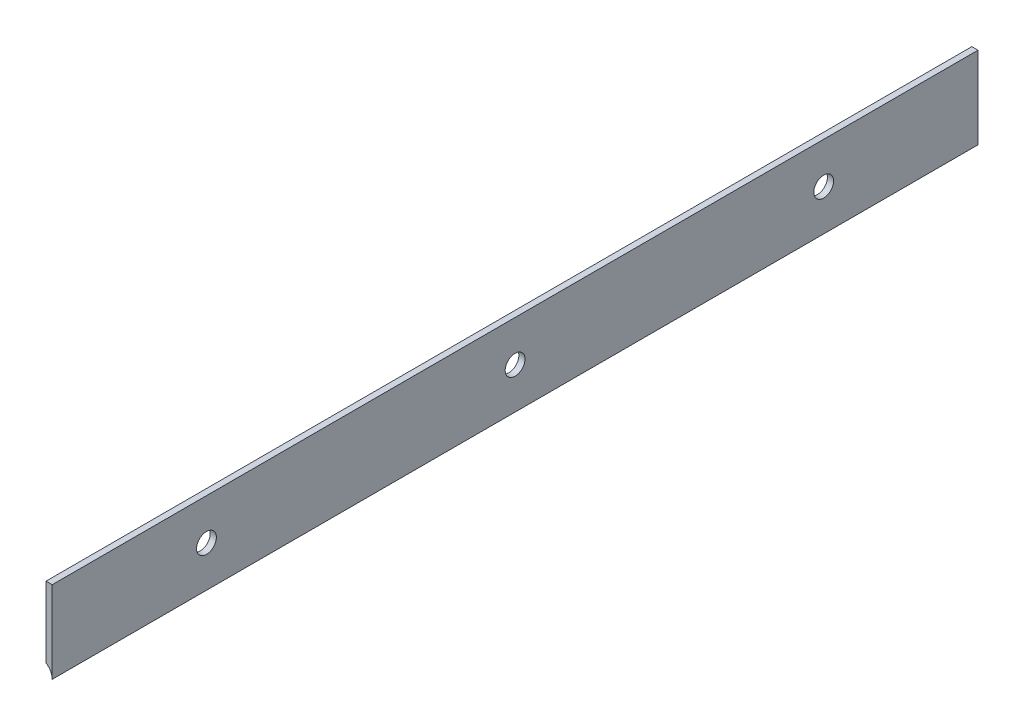
ISO-10303-21;
HEADER;
FILE_DESCRIPTION(('STEP AP214'),'2;1');
FILE_NAME('part.step','',(''),(''),'','','');
FILE_SCHEMA(('AUTOMOTIVE_DESIGN { 1 0 10303 214 1 1 1 1 }'));
ENDSEC;
DATA;
#1=APPLICATION_CONTEXT('core data for automotive mechanical design processes');
#2=APPLICATION_PROTOCOL_DEFINITION('international standard','automotive_design',2000,#1);
#3=PRODUCT_CONTEXT('',#1,'mechanical');
#4=PRODUCT('Part','Part','',(#3));
#5=PRODUCT_RELATED_PRODUCT_CATEGORY('part','',(#4));
#6=PRODUCT_DEFINITION_FORMATION('','',#4);
#7=PRODUCT_DEFINITION_CONTEXT('part definition',#1,'design');
#8=PRODUCT_DEFINITION('design','',#6,#7);
#9=PRODUCT_DEFINITION_SHAPE('','',#8);
#10=(LENGTH_UNIT() NAMED_UNIT(*) SI_UNIT(.MILLI.,.METRE.));
#11=(NAMED_UNIT(*) PLANE_ANGLE_UNIT() SI_UNIT($,.RADIAN.));
#12=(NAMED_UNIT(*) SI_UNIT($,.STERADIAN.) SOLID_ANGLE_UNIT());
#13=UNCERTAINTY_MEASURE_WITH_UNIT(LENGTH_MEASURE(1.E-05),#10,'distance_accuracy_value','');
#14=(GEOMETRIC_REPRESENTATION_CONTEXT(3) GLOBAL_UNCERTAINTY_ASSIGNED_CONTEXT((#13)) GLOBAL_UNIT_ASSIGNED_CONTEXT((#10,
#11,#12)) REPRESENTATION_CONTEXT('',''));
#15=CARTESIAN_POINT('',(0.,0.,0.));
#16=DIRECTION('',(0.,0.,1.));
#17=DIRECTION('',(1.,0.,0.));
#18=AXIS2_PLACEMENT_3D('',#15,#16,#17);
#19=CARTESIAN_POINT('',(0.507999999999999,-6.746875,152.4));
#20=DIRECTION('',(-1.,0.,0.));
#21=DIRECTION('',(0.,0.,1.));
#22=AXIS2_PLACEMENT_3D('',#19,#20,#21);
#23=PLANE('',#22);
#24=CARTESIAN_POINT('',(0.508,7.21644966006352E-13,25.4000000000001));
#25=DIRECTION('',(1.,0.,0.));
#26=DIRECTION('',(0.,0.,-1.));
#27=AXIS2_PLACEMENT_3D('',#24,#25,#26);
#28=CIRCLE('',#27,1.63194999999999);
#29=CARTESIAN_POINT('',(0.508,7.21644966006352E-13,23.7680500000001));
#30=VERTEX_POINT('',#29);
#31=EDGE_CURVE('E119',#30,#30,#28,.T.);
#32=ORIENTED_EDGE('',*,*,#31,.F.);
#33=EDGE_LOOP('',(#32));
#34=FACE_BOUND('',#33,.T.);
#35=CARTESIAN_POINT('',(0.508,5.55111512312578E-13,76.2));
#36=DIRECTION('',(1.,0.,0.));
#37=DIRECTION('',(0.,0.,-1.));
#38=AXIS2_PLACEMENT_3D('',#35,#36,#37);
#39=CIRCLE('',#38,1.63194999999999);
#40=CARTESIAN_POINT('',(0.508,5.55111512312578E-13,74.5680500000001));
#41=VERTEX_POINT('',#40);
#42=EDGE_CURVE('E109',#41,#41,#39,.T.);
#43=ORIENTED_EDGE('',*,*,#42,.F.);
#44=EDGE_LOOP('',(#43));
#45=FACE_BOUND('',#44,.T.);
#46=CARTESIAN_POINT('',(0.508,3.33066907387547E-13,127.));
#47=DIRECTION('',(1.,0.,0.));
#48=DIRECTION('',(0.,0.,-1.));
#49=AXIS2_PLACEMENT_3D('',#46,#47,#48);
#50=CIRCLE('',#49,1.63194999999999);
#51=CARTESIAN_POINT('',(0.508,3.33066907387547E-13,125.36805));
#52=VERTEX_POINT('',#51);
#53=EDGE_CURVE('E108',#52,#52,#50,.T.);
#54=ORIENTED_EDGE('',*,*,#53,.F.);
#55=EDGE_LOOP('',(#54));
#56=FACE_BOUND('',#55,.T.);
#57=DIRECTION('',(0.,1.,0.));
#58=VECTOR('',#57,1.);
#59=CARTESIAN_POINT('',(0.507999999999999,-6.746875,0.));
#60=LINE('',#59,#58);
#61=CARTESIAN_POINT('',(0.507999999999998,-6.746875,0.));
#62=VERTEX_POINT('',#61);
#63=CARTESIAN_POINT('',(0.507999999999999,6.746875,0.));
#64=VERTEX_POINT('',#63);
#65=EDGE_CURVE('E98',#62,#64,#60,.T.);
#66=ORIENTED_EDGE('',*,*,#65,.T.);
#67=DIRECTION('',(0.,0.,-1.));
#68=VECTOR('',#67,1.);
#69=CARTESIAN_POINT('',(0.507999999999999,6.746875,152.4));
#70=LINE('',#69,#68);
#71=CARTESIAN_POINT('',(0.507999999999999,6.746875,152.4));
#72=VERTEX_POINT('',#71);
#73=EDGE_CURVE('E11',#72,#64,#70,.T.);
#74=ORIENTED_EDGE('',*,*,#73,.F.);
#75=DIRECTION('',(0.,1.,0.));
#76=VECTOR('',#75,1.);
#77=CARTESIAN_POINT('',(0.507999999999999,-6.746875,152.4));
#78=LINE('',#77,#76);
#79=CARTESIAN_POINT('',(0.507999999999998,-6.746875,152.4));
#80=VERTEX_POINT('',#79);
#81=EDGE_CURVE('E85',#80,#72,#78,.T.);
#82=ORIENTED_EDGE('',*,*,#81,.F.);
#83=DIRECTION('',(0.,0.,-1.));
#84=VECTOR('',#83,1.);
#85=CARTESIAN_POINT('',(0.507999999999998,-6.746875,152.4));
#86=LINE('',#85,#84);
#87=EDGE_CURVE('E94',#80,#62,#86,.T.);
#88=ORIENTED_EDGE('',*,*,#87,.T.);
#89=EDGE_LOOP('',(#66,#74,#82,#88));
#90=FACE_BOUND('',#89,.T.);
#91=ADVANCED_FACE('F32',(#34,#45,#56,#90),#23,.F.);
#92=CARTESIAN_POINT('',(-0.508000000000001,6.746875,152.4));
#93=DIRECTION('',(0.,-1.,0.));
#94=DIRECTION('',(0.,0.,-1.));
#95=AXIS2_PLACEMENT_3D('',#92,#93,#94);
#96=PLANE('',#95);
#97=DIRECTION('',(-1.,0.,0.));
#98=VECTOR('',#97,1.);
#99=CARTESIAN_POINT('',(-0.508000000000001,6.746875,0.));
#100=LINE('',#99,#98);
#101=CARTESIAN_POINT('',(-0.508000000000001,6.746875,0.));
#102=VERTEX_POINT('',#101);
#103=EDGE_CURVE('E89',#64,#102,#100,.T.);
#104=ORIENTED_EDGE('',*,*,#103,.T.);
#105=DIRECTION('',(0.,0.,-1.));
#106=VECTOR('',#105,1.);
#107=CARTESIAN_POINT('',(-0.508000000000001,6.746875,152.4));
#108=LINE('',#107,#106);
#109=CARTESIAN_POINT('',(-0.508000000000001,6.746875,152.4));
#110=VERTEX_POINT('',#109);
#111=EDGE_CURVE('E41',#110,#102,#108,.T.);
#112=ORIENTED_EDGE('',*,*,#111,.F.);
#113=DIRECTION('',(-1.,0.,0.));
#114=VECTOR('',#113,1.);
#115=CARTESIAN_POINT('',(-0.508000000000001,6.746875,152.4));
#116=LINE('',#115,#114);
#117=EDGE_CURVE('E80',#72,#110,#116,.T.);
#118=ORIENTED_EDGE('',*,*,#117,.F.);
#119=ORIENTED_EDGE('',*,*,#73,.T.);
#120=EDGE_LOOP('',(#104,#112,#118,#119));
#121=FACE_BOUND('',#120,.T.);
#122=ADVANCED_FACE('F88',(#121),#96,.F.);
#123=CARTESIAN_POINT('',(-0.508000000000001,-4.91525495206429,152.4));
#124=DIRECTION('',(1.,0.,0.));
#125=DIRECTION('',(0.,0.,-1.));
#126=AXIS2_PLACEMENT_3D('',#123,#124,#125);
#127=PLANE('',#126);
#128=CARTESIAN_POINT('',(-0.508000000000001,7.21644966006352E-13,25.4000000000001));
#129=DIRECTION('',(1.,0.,0.));
#130=DIRECTION('',(0.,0.,-1.));
#131=AXIS2_PLACEMENT_3D('',#128,#129,#130);
#132=CIRCLE('',#131,1.63194999999999);
#133=CARTESIAN_POINT('',(-0.508000000000001,7.21644966006352E-13,23.7680500000001));
#134=VERTEX_POINT('',#133);
#135=EDGE_CURVE('E35',#134,#134,#132,.T.);
#136=ORIENTED_EDGE('',*,*,#135,.T.);
#137=EDGE_LOOP('',(#136));
#138=FACE_BOUND('',#137,.T.);
#139=CARTESIAN_POINT('',(-0.508000000000001,5.55111512312578E-13,76.2));
#140=DIRECTION('',(1.,0.,0.));
#141=DIRECTION('',(0.,0.,-1.));
#142=AXIS2_PLACEMENT_3D('',#139,#140,#141);
#143=CIRCLE('',#142,1.63194999999999);
#144=CARTESIAN_POINT('',(-0.508000000000001,5.55111512312578E-13,74.5680500000001));
#145=VERTEX_POINT('',#144);
#146=EDGE_CURVE('E106',#145,#145,#143,.T.);
#147=ORIENTED_EDGE('',*,*,#146,.T.);
#148=EDGE_LOOP('',(#147));
#149=FACE_BOUND('',#148,.T.);
#150=CARTESIAN_POINT('',(-0.508000000000001,3.33066907387547E-13,127.));
#151=DIRECTION('',(1.,0.,0.));
#152=DIRECTION('',(0.,0.,-1.));
#153=AXIS2_PLACEMENT_3D('',#150,#151,#152);
#154=CIRCLE('',#153,1.63194999999999);
#155=CARTESIAN_POINT('',(-0.508000000000001,3.33066907387547E-13,125.36805));
#156=VERTEX_POINT('',#155);
#157=EDGE_CURVE('E101',#156,#156,#154,.T.);
#158=ORIENTED_EDGE('',*,*,#157,.T.);
#159=EDGE_LOOP('',(#158));
#160=FACE_BOUND('',#159,.T.);
#161=DIRECTION('',(0.,-1.,0.));
#162=VECTOR('',#161,1.);
#163=CARTESIAN_POINT('',(-0.508000000000001,-4.91525495206429,0.));
#164=LINE('',#163,#162);
#165=CARTESIAN_POINT('',(-0.508000000000001,-4.91525495206429,0.));
#166=VERTEX_POINT('',#165);
#167=EDGE_CURVE('E67',#102,#166,#164,.T.);
#168=ORIENTED_EDGE('',*,*,#167,.T.);
#169=DIRECTION('',(0.,0.,-1.));
#170=VECTOR('',#169,1.);
#171=CARTESIAN_POINT('',(-0.508000000000001,-4.91525495206429,152.4));
#172=LINE('',#171,#170);
#173=CARTESIAN_POINT('',(-0.508000000000001,-4.91525495206429,152.4));
#174=VERTEX_POINT('',#173);
#175=EDGE_CURVE('E90',#174,#166,#172,.T.);
#176=ORIENTED_EDGE('',*,*,#175,.F.);
#177=DIRECTION('',(0.,-1.,0.));
#178=VECTOR('',#177,1.);
#179=CARTESIAN_POINT('',(-0.508000000000001,-4.91525495206429,152.4));
#180=LINE('',#179,#178);
#181=EDGE_CURVE('E83',#110,#174,#180,.T.);
#182=ORIENTED_EDGE('',*,*,#181,.F.);
#183=ORIENTED_EDGE('',*,*,#111,.T.);
#184=EDGE_LOOP('',(#168,#176,#182,#183));
#185=FACE_BOUND('',#184,.T.);
#186=ADVANCED_FACE('F92',(#138,#149,#160,#185),#127,.F.);
#187=CARTESIAN_POINT('',(-1.651,-6.746875,152.4));
#188=DIRECTION('',(0.,0.,-1.));
#189=DIRECTION('',(-1.,0.,0.));
#190=AXIS2_PLACEMENT_3D('',#187,#188,#189);
#191=CYLINDRICAL_SURFACE('',#190,2.159);
#192=CARTESIAN_POINT('',(-1.651,-6.746875,0.));
#193=DIRECTION('',(0.,0.,-1.));
#194=DIRECTION('',(1.,0.,0.));
#195=AXIS2_PLACEMENT_3D('',#192,#193,#194);
#196=CIRCLE('',#195,2.159);
#197=EDGE_CURVE('E73',#166,#62,#196,.T.);
#198=ORIENTED_EDGE('',*,*,#197,.T.);
#199=ORIENTED_EDGE('',*,*,#87,.F.);
#200=CARTESIAN_POINT('',(-1.651,-6.746875,152.4));
#201=DIRECTION('',(0.,0.,-1.));
#202=DIRECTION('',(1.,0.,0.));
#203=AXIS2_PLACEMENT_3D('',#200,#201,#202);
#204=CIRCLE('',#203,2.159);
#205=EDGE_CURVE('E50',#174,#80,#204,.T.);
#206=ORIENTED_EDGE('',*,*,#205,.F.);
#207=ORIENTED_EDGE('',*,*,#175,.T.);
#208=EDGE_LOOP('',(#198,#199,#206,#207));
#209=FACE_BOUND('',#208,.T.);
#210=ADVANCED_FACE('F153',(#209),#191,.F.);
#211=CARTESIAN_POINT('',(-1.651,-6.746875,152.4));
#212=DIRECTION('',(0.,0.,1.));
#213=DIRECTION('',(1.,0.,0.));
#214=AXIS2_PLACEMENT_3D('',#211,#212,#213);
#215=PLANE('',#214);
#216=ORIENTED_EDGE('',*,*,#81,.T.);
#217=ORIENTED_EDGE('',*,*,#117,.T.);
#218=ORIENTED_EDGE('',*,*,#181,.T.);
#219=ORIENTED_EDGE('',*,*,#205,.T.);
#220=EDGE_LOOP('',(#216,#217,#218,#219));
#221=FACE_BOUND('',#220,.T.);
#222=ADVANCED_FACE('F81',(#221),#215,.T.);
#223=CARTESIAN_POINT('',(-1.651,-6.746875,0.));
#224=DIRECTION('',(0.,0.,1.));
#225=DIRECTION('',(1.,0.,0.));
#226=AXIS2_PLACEMENT_3D('',#223,#224,#225);
#227=PLANE('',#226);
#228=ORIENTED_EDGE('',*,*,#65,.F.);
#229=ORIENTED_EDGE('',*,*,#197,.F.);
#230=ORIENTED_EDGE('',*,*,#167,.F.);
#231=ORIENTED_EDGE('',*,*,#103,.F.);
#232=EDGE_LOOP('',(#228,#229,#230,#231));
#233=FACE_BOUND('',#232,.T.);
#234=ADVANCED_FACE('F129',(#233),#227,.F.);
#235=CARTESIAN_POINT('',(0.507999999999999,3.33066907387547E-13,127.));
#236=DIRECTION('',(1.,0.,0.));
#237=DIRECTION('',(0.,0.,-1.));
#238=AXIS2_PLACEMENT_3D('',#235,#236,#237);
#239=CYLINDRICAL_SURFACE('',#238,1.63194999999999);
#240=ORIENTED_EDGE('',*,*,#53,.T.);
#241=EDGE_LOOP('',(#240));
#242=FACE_BOUND('',#241,.T.);
#243=ORIENTED_EDGE('',*,*,#157,.F.);
#244=EDGE_LOOP('',(#243));
#245=FACE_BOUND('',#244,.T.);
#246=ADVANCED_FACE('F126',(#242,#245),#239,.F.);
#247=CARTESIAN_POINT('',(0.507999999999999,5.55111512312578E-13,76.2));
#248=DIRECTION('',(1.,0.,0.));
#249=DIRECTION('',(0.,0.,-1.));
#250=AXIS2_PLACEMENT_3D('',#247,#248,#249);
#251=CYLINDRICAL_SURFACE('',#250,1.63194999999999);
#252=ORIENTED_EDGE('',*,*,#42,.T.);
#253=EDGE_LOOP('',(#252));
#254=FACE_BOUND('',#253,.T.);
#255=ORIENTED_EDGE('',*,*,#146,.F.);
#256=EDGE_LOOP('',(#255));
#257=FACE_BOUND('',#256,.T.);
#258=ADVANCED_FACE('F128',(#254,#257),#251,.F.);
#259=CARTESIAN_POINT('',(0.507999999999999,7.21644966006352E-13,25.4000000000001));
#260=DIRECTION('',(1.,0.,0.));
#261=DIRECTION('',(0.,0.,-1.));
#262=AXIS2_PLACEMENT_3D('',#259,#260,#261);
#263=CYLINDRICAL_SURFACE('',#262,1.63194999999999);
#264=ORIENTED_EDGE('',*,*,#31,.T.);
#265=EDGE_LOOP('',(#264));
#266=FACE_BOUND('',#265,.T.);
#267=ORIENTED_EDGE('',*,*,#135,.F.);
#268=EDGE_LOOP('',(#267));
#269=FACE_BOUND('',#268,.T.);
#270=ADVANCED_FACE('F136',(#266,#269),#263,.F.);
#271=CLOSED_SHELL('',(#91,#122,#186,#210,#222,#234,#246,#258,#270));
#272=MANIFOLD_SOLID_BREP('B2',#271);
#273=ADVANCED_BREP_SHAPE_REPRESENTATION('',(#18,#272),#14);
#274=SHAPE_DEFINITION_REPRESENTATION(#9,#273);
ENDSEC;
END-ISO-10303-21;
